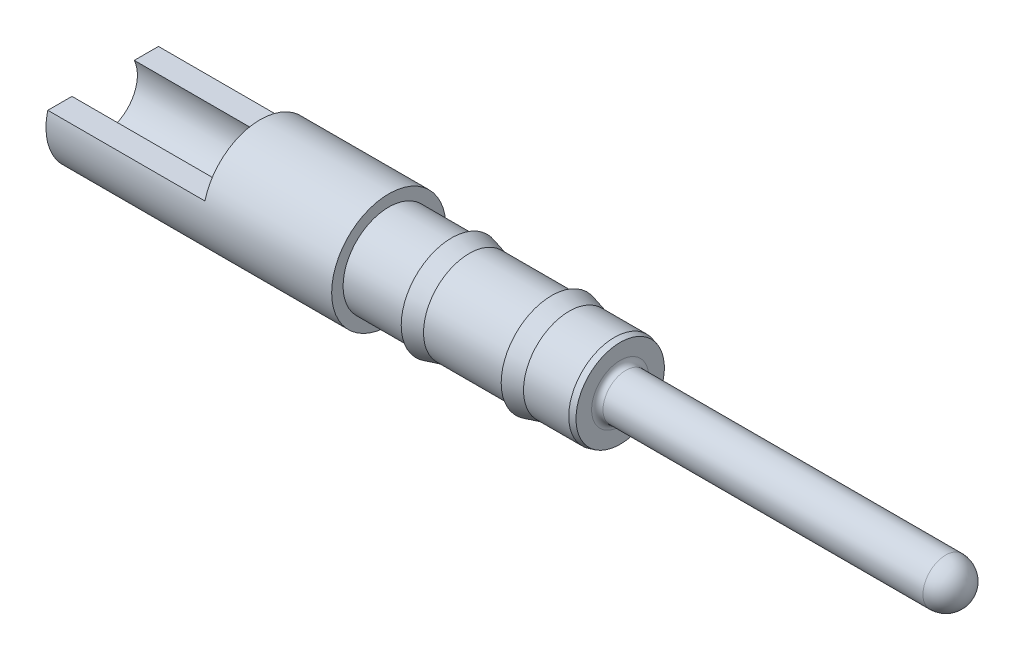
ISO-10303-21;
HEADER;
FILE_DESCRIPTION(('STEP AP214'),'2;1');
FILE_NAME('part.step','',(''),(''),'','','');
FILE_SCHEMA(('AUTOMOTIVE_DESIGN { 1 0 10303 214 1 1 1 1 }'));
ENDSEC;
DATA;
#1=APPLICATION_CONTEXT('core data for automotive mechanical design processes');
#2=APPLICATION_PROTOCOL_DEFINITION('international standard','automotive_design',2000,#1);
#3=PRODUCT_CONTEXT('',#1,'mechanical');
#4=PRODUCT('Part','Part','',(#3));
#5=PRODUCT_RELATED_PRODUCT_CATEGORY('part','',(#4));
#6=PRODUCT_DEFINITION_FORMATION('','',#4);
#7=PRODUCT_DEFINITION_CONTEXT('part definition',#1,'design');
#8=PRODUCT_DEFINITION('design','',#6,#7);
#9=PRODUCT_DEFINITION_SHAPE('','',#8);
#10=(LENGTH_UNIT() NAMED_UNIT(*) SI_UNIT(.MILLI.,.METRE.));
#11=(NAMED_UNIT(*) PLANE_ANGLE_UNIT() SI_UNIT($,.RADIAN.));
#12=(NAMED_UNIT(*) SI_UNIT($,.STERADIAN.) SOLID_ANGLE_UNIT());
#13=UNCERTAINTY_MEASURE_WITH_UNIT(LENGTH_MEASURE(1.E-05),#10,'distance_accuracy_value','');
#14=(GEOMETRIC_REPRESENTATION_CONTEXT(3) GLOBAL_UNCERTAINTY_ASSIGNED_CONTEXT((#13)) GLOBAL_UNIT_ASSIGNED_CONTEXT((#10,
#11,#12)) REPRESENTATION_CONTEXT('',''));
#15=CARTESIAN_POINT('',(0.,0.,0.));
#16=DIRECTION('',(0.,0.,1.));
#17=DIRECTION('',(1.,0.,0.));
#18=AXIS2_PLACEMENT_3D('',#15,#16,#17);
#19=CARTESIAN_POINT('',(0.,0.,0.));
#20=DIRECTION('',(-1.,0.,0.));
#21=DIRECTION('',(0.,0.,1.));
#22=AXIS2_PLACEMENT_3D('',#19,#20,#21);
#23=CYLINDRICAL_SURFACE('',#22,0.508);
#24=CARTESIAN_POINT('',(2.54,0.,0.));
#25=DIRECTION('',(-1.,0.,0.));
#26=DIRECTION('',(0.,0.,1.));
#27=AXIS2_PLACEMENT_3D('',#24,#25,#26);
#28=CIRCLE('',#27,0.508);
#29=CARTESIAN_POINT('',(2.54,0.,0.508));
#30=VERTEX_POINT('',#29);
#31=EDGE_CURVE('E86',#30,#30,#28,.T.);
#32=ORIENTED_EDGE('',*,*,#31,.T.);
#33=EDGE_LOOP('',(#32));
#34=FACE_BOUND('',#33,.T.);
#35=DIRECTION('',(-1.,0.,0.));
#36=VECTOR('',#35,1.);
#37=CARTESIAN_POINT('',(0.,0.127,-0.491868884968342));
#38=LINE('',#37,#36);
#39=CARTESIAN_POINT('',(1.397,0.127,-0.491868884968342));
#40=VERTEX_POINT('',#39);
#41=CARTESIAN_POINT('',(0.,0.127,-0.491868884968342));
#42=VERTEX_POINT('',#41);
#43=EDGE_CURVE('E67',#40,#42,#38,.T.);
#44=ORIENTED_EDGE('',*,*,#43,.F.);
#45=CARTESIAN_POINT('',(1.397,0.,0.));
#46=DIRECTION('',(-1.,0.,0.));
#47=DIRECTION('',(0.,0.,1.));
#48=AXIS2_PLACEMENT_3D('',#45,#46,#47);
#49=CIRCLE('',#48,0.508);
#50=CARTESIAN_POINT('',(1.397,0.127,0.491868884968342));
#51=VERTEX_POINT('',#50);
#52=EDGE_CURVE('E68',#51,#40,#49,.T.);
#53=ORIENTED_EDGE('',*,*,#52,.F.);
#54=DIRECTION('',(-1.,0.,0.));
#55=VECTOR('',#54,1.);
#56=CARTESIAN_POINT('',(0.,0.127,0.491868884968342));
#57=LINE('',#56,#55);
#58=CARTESIAN_POINT('',(0.,0.127,0.491868884968342));
#59=VERTEX_POINT('',#58);
#60=EDGE_CURVE('E56',#59,#51,#57,.F.);
#61=ORIENTED_EDGE('',*,*,#60,.F.);
#62=CARTESIAN_POINT('',(0.,0.,0.));
#63=DIRECTION('',(-1.,0.,0.));
#64=DIRECTION('',(0.,0.,1.));
#65=AXIS2_PLACEMENT_3D('',#62,#63,#64);
#66=CIRCLE('',#65,0.508);
#67=EDGE_CURVE('E125',#42,#59,#66,.T.);
#68=ORIENTED_EDGE('',*,*,#67,.F.);
#69=EDGE_LOOP('',(#44,#53,#61,#68));
#70=FACE_BOUND('',#69,.T.);
#71=ADVANCED_FACE('F17',(#34,#70),#23,.T.);
#72=CARTESIAN_POINT('',(0.,0.508,0.));
#73=DIRECTION('',(1.,0.,0.));
#74=DIRECTION('',(0.,0.,-1.));
#75=AXIS2_PLACEMENT_3D('',#72,#73,#74);
#76=PLANE('',#75);
#77=DIRECTION('',(0.,0.,-1.));
#78=VECTOR('',#77,1.);
#79=CARTESIAN_POINT('',(0.,0.127,2.54));
#80=LINE('',#79,#78);
#81=CARTESIAN_POINT('',(0.,0.127,-0.277081287711747));
#82=VERTEX_POINT('',#81);
#83=EDGE_CURVE('E73',#82,#42,#80,.T.);
#84=ORIENTED_EDGE('',*,*,#83,.T.);
#85=ORIENTED_EDGE('',*,*,#67,.T.);
#86=CARTESIAN_POINT('',(0.,0.127,0.277081287711747));
#87=VERTEX_POINT('',#86);
#88=EDGE_CURVE('E62',#59,#87,#80,.T.);
#89=ORIENTED_EDGE('',*,*,#88,.T.);
#90=CARTESIAN_POINT('',(0.,0.,0.));
#91=DIRECTION('',(-1.,0.,0.));
#92=DIRECTION('',(0.,0.,1.));
#93=AXIS2_PLACEMENT_3D('',#90,#91,#92);
#94=CIRCLE('',#93,0.304799999999999);
#95=EDGE_CURVE('E80',#82,#87,#94,.T.);
#96=ORIENTED_EDGE('',*,*,#95,.F.);
#97=EDGE_LOOP('',(#84,#85,#89,#96));
#98=FACE_BOUND('',#97,.T.);
#99=ADVANCED_FACE('F131',(#98),#76,.F.);
#100=CARTESIAN_POINT('',(0.,0.,0.));
#101=DIRECTION('',(-1.,0.,0.));
#102=DIRECTION('',(0.,0.,1.));
#103=AXIS2_PLACEMENT_3D('',#100,#101,#102);
#104=CYLINDRICAL_SURFACE('',#103,0.304799999999999);
#105=CARTESIAN_POINT('',(2.54,0.,0.));
#106=DIRECTION('',(-1.,0.,0.));
#107=DIRECTION('',(0.,0.,1.));
#108=AXIS2_PLACEMENT_3D('',#105,#106,#107);
#109=CIRCLE('',#108,0.3048);
#110=CARTESIAN_POINT('',(2.54,0.,0.3048));
#111=VERTEX_POINT('',#110);
#112=EDGE_CURVE('E83',#111,#111,#109,.T.);
#113=ORIENTED_EDGE('',*,*,#112,.F.);
#114=EDGE_LOOP('',(#113));
#115=FACE_BOUND('',#114,.T.);
#116=DIRECTION('',(-1.,0.,0.));
#117=VECTOR('',#116,1.);
#118=CARTESIAN_POINT('',(0.,0.127,-0.277081287711747));
#119=LINE('',#118,#117);
#120=CARTESIAN_POINT('',(1.397,0.127,-0.277081287711747));
#121=VERTEX_POINT('',#120);
#122=EDGE_CURVE('E11',#82,#121,#119,.F.);
#123=ORIENTED_EDGE('',*,*,#122,.F.);
#124=ORIENTED_EDGE('',*,*,#95,.T.);
#125=DIRECTION('',(-1.,0.,0.));
#126=VECTOR('',#125,1.);
#127=CARTESIAN_POINT('',(0.,0.127,0.277081287711747));
#128=LINE('',#127,#126);
#129=CARTESIAN_POINT('',(1.397,0.127,0.277081287711747));
#130=VERTEX_POINT('',#129);
#131=EDGE_CURVE('E24',#130,#87,#128,.T.);
#132=ORIENTED_EDGE('',*,*,#131,.F.);
#133=CARTESIAN_POINT('',(1.397,0.,0.));
#134=DIRECTION('',(-1.,0.,0.));
#135=DIRECTION('',(0.,0.,1.));
#136=AXIS2_PLACEMENT_3D('',#133,#134,#135);
#137=CIRCLE('',#136,0.304799999999999);
#138=EDGE_CURVE('E72',#121,#130,#137,.F.);
#139=ORIENTED_EDGE('',*,*,#138,.F.);
#140=EDGE_LOOP('',(#123,#124,#132,#139));
#141=FACE_BOUND('',#140,.T.);
#142=ADVANCED_FACE('F133',(#115,#141),#104,.F.);
#143=CARTESIAN_POINT('',(7.49299999999993,0.,0.));
#144=DIRECTION('',(-1.,0.,0.));
#145=DIRECTION('',(0.,1.,0.));
#146=AXIS2_PLACEMENT_3D('',#143,#144,#145);
#147=SPHERICAL_SURFACE('',#146,0.20320000000007);
#148=CARTESIAN_POINT('',(7.49299999999993,0.,0.));
#149=DIRECTION('',(-1.,0.,0.));
#150=DIRECTION('',(0.,0.,1.));
#151=AXIS2_PLACEMENT_3D('',#148,#149,#150);
#152=CIRCLE('',#151,0.203200000000042);
#153=CARTESIAN_POINT('',(7.49299999999993,0.,0.203200000000042));
#154=VERTEX_POINT('',#153);
#155=EDGE_CURVE('E122',#154,#154,#152,.T.);
#156=ORIENTED_EDGE('',*,*,#155,.F.);
#157=EDGE_LOOP('',(#156));
#158=FACE_BOUND('',#157,.T.);
#159=ADVANCED_FACE('F223',(#158),#147,.T.);
#160=CARTESIAN_POINT('',(0.,0.,0.));
#161=DIRECTION('',(-1.,0.,0.));
#162=DIRECTION('',(0.,0.,1.));
#163=AXIS2_PLACEMENT_3D('',#160,#161,#162);
#164=CYLINDRICAL_SURFACE('',#163,0.203200000000042);
#165=CARTESIAN_POINT('',(4.6482000000001,0.,0.));
#166=DIRECTION('',(-1.,0.,0.));
#167=DIRECTION('',(0.,0.,1.));
#168=AXIS2_PLACEMENT_3D('',#165,#166,#167);
#169=CIRCLE('',#168,0.203200000000042);
#170=CARTESIAN_POINT('',(4.6482000000001,0.,0.203200000000042));
#171=VERTEX_POINT('',#170);
#172=EDGE_CURVE('E119',#171,#171,#169,.T.);
#173=ORIENTED_EDGE('',*,*,#172,.F.);
#174=EDGE_LOOP('',(#173));
#175=FACE_BOUND('',#174,.T.);
#176=ORIENTED_EDGE('',*,*,#155,.T.);
#177=EDGE_LOOP('',(#176));
#178=FACE_BOUND('',#177,.T.);
#179=ADVANCED_FACE('F217',(#175,#178),#164,.T.);
#180=CARTESIAN_POINT('',(4.6482000000001,0.,0.));
#181=DIRECTION('',(-1.,0.,0.));
#182=DIRECTION('',(0.,0.,1.));
#183=AXIS2_PLACEMENT_3D('',#180,#181,#182);
#184=TOROIDAL_SURFACE('',#183,0.254000000000032,0.0507999999999898);
#185=CARTESIAN_POINT('',(4.59740000000011,0.,0.));
#186=DIRECTION('',(-1.,0.,0.));
#187=DIRECTION('',(0.,0.,1.));
#188=AXIS2_PLACEMENT_3D('',#185,#186,#187);
#189=CIRCLE('',#188,0.254000000000032);
#190=CARTESIAN_POINT('',(4.59740000000011,0.,0.254000000000032));
#191=VERTEX_POINT('',#190);
#192=EDGE_CURVE('E116',#191,#191,#189,.T.);
#193=ORIENTED_EDGE('',*,*,#192,.F.);
#194=EDGE_LOOP('',(#193));
#195=FACE_BOUND('',#194,.T.);
#196=ORIENTED_EDGE('',*,*,#172,.T.);
#197=EDGE_LOOP('',(#196));
#198=FACE_BOUND('',#197,.T.);
#199=ADVANCED_FACE('F211',(#195,#198),#184,.F.);
#200=CARTESIAN_POINT('',(4.59740000000011,0.392788181024502,0.));
#201=DIRECTION('',(-1.,0.,0.));
#202=DIRECTION('',(0.,0.,1.));
#203=AXIS2_PLACEMENT_3D('',#200,#201,#202);
#204=PLANE('',#203);
#205=CARTESIAN_POINT('',(4.59740000000011,0.,0.));
#206=DIRECTION('',(-1.,0.,0.));
#207=DIRECTION('',(0.,0.,1.));
#208=AXIS2_PLACEMENT_3D('',#205,#206,#207);
#209=CIRCLE('',#208,0.392788181024502);
#210=CARTESIAN_POINT('',(4.59740000000011,0.,0.392788181024502));
#211=VERTEX_POINT('',#210);
#212=EDGE_CURVE('E113',#211,#211,#209,.T.);
#213=ORIENTED_EDGE('',*,*,#212,.F.);
#214=EDGE_LOOP('',(#213));
#215=FACE_BOUND('',#214,.T.);
#216=ORIENTED_EDGE('',*,*,#192,.T.);
#217=EDGE_LOOP('',(#216));
#218=FACE_BOUND('',#217,.T.);
#219=ADVANCED_FACE('F205',(#215,#218),#204,.F.);
#220=CARTESIAN_POINT('',(4.59740000000011,0.,0.));
#221=DIRECTION('',(-1.,0.,0.));
#222=DIRECTION('',(0.,0.,1.));
#223=AXIS2_PLACEMENT_3D('',#220,#221,#222);
#224=CONICAL_SURFACE('',#223,0.392788181024502,0.261799387799401);
#225=CARTESIAN_POINT('',(4.54660000000007,0.,0.));
#226=DIRECTION('',(-1.,0.,0.));
#227=DIRECTION('',(0.,0.,1.));
#228=AXIS2_PLACEMENT_3D('',#225,#226,#227);
#229=CIRCLE('',#228,0.406400000000029);
#230=CARTESIAN_POINT('',(4.54660000000007,0.,0.406400000000029));
#231=VERTEX_POINT('',#230);
#232=EDGE_CURVE('E110',#231,#231,#229,.T.);
#233=ORIENTED_EDGE('',*,*,#232,.F.);
#234=EDGE_LOOP('',(#233));
#235=FACE_BOUND('',#234,.T.);
#236=ORIENTED_EDGE('',*,*,#212,.T.);
#237=EDGE_LOOP('',(#236));
#238=FACE_BOUND('',#237,.T.);
#239=ADVANCED_FACE('F199',(#235,#238),#224,.T.);
#240=CARTESIAN_POINT('',(0.,0.,0.));
#241=DIRECTION('',(-1.,0.,0.));
#242=DIRECTION('',(0.,0.,1.));
#243=AXIS2_PLACEMENT_3D('',#240,#241,#242);
#244=CYLINDRICAL_SURFACE('',#243,0.406400000000029);
#245=CARTESIAN_POINT('',(4.14421024934499,0.,0.));
#246=DIRECTION('',(-1.,0.,0.));
#247=DIRECTION('',(0.,0.,1.));
#248=AXIS2_PLACEMENT_3D('',#245,#246,#247);
#249=CIRCLE('',#248,0.406400000000029);
#250=CARTESIAN_POINT('',(4.14421024934499,0.,0.406400000000029));
#251=VERTEX_POINT('',#250);
#252=EDGE_CURVE('E107',#251,#251,#249,.T.);
#253=ORIENTED_EDGE('',*,*,#252,.F.);
#254=EDGE_LOOP('',(#253));
#255=FACE_BOUND('',#254,.T.);
#256=ORIENTED_EDGE('',*,*,#232,.T.);
#257=EDGE_LOOP('',(#256));
#258=FACE_BOUND('',#257,.T.);
#259=ADVANCED_FACE('F193',(#255,#258),#244,.T.);
#260=CARTESIAN_POINT('',(4.14421024934499,0.,0.));
#261=DIRECTION('',(-1.,0.,0.));
#262=DIRECTION('',(0.,0.,1.));
#263=AXIS2_PLACEMENT_3D('',#260,#261,#262);
#264=CONICAL_SURFACE('',#263,0.406400000000029,0.261799387799401);
#265=CARTESIAN_POINT('',(3.98780000000004,0.,0.));
#266=DIRECTION('',(-1.,0.,0.));
#267=DIRECTION('',(0.,0.,1.));
#268=AXIS2_PLACEMENT_3D('',#265,#266,#267);
#269=CIRCLE('',#268,0.44831);
#270=CARTESIAN_POINT('',(3.98780000000004,0.,0.44831));
#271=VERTEX_POINT('',#270);
#272=EDGE_CURVE('E104',#271,#271,#269,.T.);
#273=ORIENTED_EDGE('',*,*,#272,.F.);
#274=EDGE_LOOP('',(#273));
#275=FACE_BOUND('',#274,.T.);
#276=ORIENTED_EDGE('',*,*,#252,.T.);
#277=EDGE_LOOP('',(#276));
#278=FACE_BOUND('',#277,.T.);
#279=ADVANCED_FACE('F187',(#275,#278),#264,.T.);
#280=CARTESIAN_POINT('',(3.98780000000004,0.406400000000029,0.));
#281=DIRECTION('',(1.,0.,0.));
#282=DIRECTION('',(0.,0.,-1.));
#283=AXIS2_PLACEMENT_3D('',#280,#281,#282);
#284=PLANE('',#283);
#285=CARTESIAN_POINT('',(3.98780000000004,0.,0.));
#286=DIRECTION('',(-1.,0.,0.));
#287=DIRECTION('',(0.,0.,1.));
#288=AXIS2_PLACEMENT_3D('',#285,#286,#287);
#289=CIRCLE('',#288,0.406400000000029);
#290=CARTESIAN_POINT('',(3.98780000000004,0.,0.406400000000029));
#291=VERTEX_POINT('',#290);
#292=EDGE_CURVE('E101',#291,#291,#289,.T.);
#293=ORIENTED_EDGE('',*,*,#292,.F.);
#294=EDGE_LOOP('',(#293));
#295=FACE_BOUND('',#294,.T.);
#296=ORIENTED_EDGE('',*,*,#272,.T.);
#297=EDGE_LOOP('',(#296));
#298=FACE_BOUND('',#297,.T.);
#299=ADVANCED_FACE('F181',(#295,#298),#284,.F.);
#300=CARTESIAN_POINT('',(0.,0.,0.));
#301=DIRECTION('',(-1.,0.,0.));
#302=DIRECTION('',(0.,0.,1.));
#303=AXIS2_PLACEMENT_3D('',#300,#301,#302);
#304=CYLINDRICAL_SURFACE('',#303,0.406400000000029);
#305=CARTESIAN_POINT('',(3.25521024934496,0.,0.));
#306=DIRECTION('',(-1.,0.,0.));
#307=DIRECTION('',(0.,0.,1.));
#308=AXIS2_PLACEMENT_3D('',#305,#306,#307);
#309=CIRCLE('',#308,0.406400000000029);
#310=CARTESIAN_POINT('',(3.25521024934496,0.,0.406400000000029));
#311=VERTEX_POINT('',#310);
#312=EDGE_CURVE('E98',#311,#311,#309,.T.);
#313=ORIENTED_EDGE('',*,*,#312,.F.);
#314=EDGE_LOOP('',(#313));
#315=FACE_BOUND('',#314,.T.);
#316=ORIENTED_EDGE('',*,*,#292,.T.);
#317=EDGE_LOOP('',(#316));
#318=FACE_BOUND('',#317,.T.);
#319=ADVANCED_FACE('F175',(#315,#318),#304,.T.);
#320=CARTESIAN_POINT('',(3.25521024934496,0.,0.));
#321=DIRECTION('',(-1.,0.,0.));
#322=DIRECTION('',(0.,0.,1.));
#323=AXIS2_PLACEMENT_3D('',#320,#321,#322);
#324=CONICAL_SURFACE('',#323,0.406400000000029,0.2617993877994);
#325=CARTESIAN_POINT('',(3.09880000000001,0.,0.));
#326=DIRECTION('',(-1.,0.,0.));
#327=DIRECTION('',(0.,0.,1.));
#328=AXIS2_PLACEMENT_3D('',#325,#326,#327);
#329=CIRCLE('',#328,0.44831);
#330=CARTESIAN_POINT('',(3.09880000000001,0.,0.44831));
#331=VERTEX_POINT('',#330);
#332=EDGE_CURVE('E95',#331,#331,#329,.T.);
#333=ORIENTED_EDGE('',*,*,#332,.F.);
#334=EDGE_LOOP('',(#333));
#335=FACE_BOUND('',#334,.T.);
#336=ORIENTED_EDGE('',*,*,#312,.T.);
#337=EDGE_LOOP('',(#336));
#338=FACE_BOUND('',#337,.T.);
#339=ADVANCED_FACE('F169',(#335,#338),#324,.T.);
#340=CARTESIAN_POINT('',(3.09880000000001,0.406400000000029,0.));
#341=DIRECTION('',(1.,0.,0.));
#342=DIRECTION('',(0.,0.,-1.));
#343=AXIS2_PLACEMENT_3D('',#340,#341,#342);
#344=PLANE('',#343);
#345=CARTESIAN_POINT('',(3.09880000000001,0.,0.));
#346=DIRECTION('',(-1.,0.,0.));
#347=DIRECTION('',(0.,0.,1.));
#348=AXIS2_PLACEMENT_3D('',#345,#346,#347);
#349=CIRCLE('',#348,0.406400000000029);
#350=CARTESIAN_POINT('',(3.09880000000001,0.,0.406400000000029));
#351=VERTEX_POINT('',#350);
#352=EDGE_CURVE('E92',#351,#351,#349,.T.);
#353=ORIENTED_EDGE('',*,*,#352,.F.);
#354=EDGE_LOOP('',(#353));
#355=FACE_BOUND('',#354,.T.);
#356=ORIENTED_EDGE('',*,*,#332,.T.);
#357=EDGE_LOOP('',(#356));
#358=FACE_BOUND('',#357,.T.);
#359=ADVANCED_FACE('F163',(#355,#358),#344,.F.);
#360=CARTESIAN_POINT('',(0.,0.,0.));
#361=DIRECTION('',(-1.,0.,0.));
#362=DIRECTION('',(0.,0.,1.));
#363=AXIS2_PLACEMENT_3D('',#360,#361,#362);
#364=CYLINDRICAL_SURFACE('',#363,0.406400000000029);
#365=CARTESIAN_POINT('',(2.54,0.,0.));
#366=DIRECTION('',(-1.,0.,0.));
#367=DIRECTION('',(0.,0.,1.));
#368=AXIS2_PLACEMENT_3D('',#365,#366,#367);
#369=CIRCLE('',#368,0.406400000000029);
#370=CARTESIAN_POINT('',(2.54,0.,0.406400000000029));
#371=VERTEX_POINT('',#370);
#372=EDGE_CURVE('E89',#371,#371,#369,.T.);
#373=ORIENTED_EDGE('',*,*,#372,.F.);
#374=EDGE_LOOP('',(#373));
#375=FACE_BOUND('',#374,.T.);
#376=ORIENTED_EDGE('',*,*,#352,.T.);
#377=EDGE_LOOP('',(#376));
#378=FACE_BOUND('',#377,.T.);
#379=ADVANCED_FACE('F157',(#375,#378),#364,.T.);
#380=CARTESIAN_POINT('',(2.54,0.406400000000029,0.));
#381=DIRECTION('',(-1.,0.,0.));
#382=DIRECTION('',(0.,0.,1.));
#383=AXIS2_PLACEMENT_3D('',#380,#381,#382);
#384=PLANE('',#383);
#385=ORIENTED_EDGE('',*,*,#31,.F.);
#386=EDGE_LOOP('',(#385));
#387=FACE_BOUND('',#386,.T.);
#388=ORIENTED_EDGE('',*,*,#372,.T.);
#389=EDGE_LOOP('',(#388));
#390=FACE_BOUND('',#389,.T.);
#391=ADVANCED_FACE('F144',(#387,#390),#384,.F.);
#392=CARTESIAN_POINT('',(2.54,0.,0.));
#393=DIRECTION('',(-1.,0.,0.));
#394=DIRECTION('',(0.,0.,1.));
#395=AXIS2_PLACEMENT_3D('',#392,#393,#394);
#396=CONICAL_SURFACE('',#395,0.3048,1.02974425867666);
#397=CARTESIAN_POINT('',(2.7231423166796,0.,0.));
#398=VERTEX_POINT('',#397);
#399=VERTEX_LOOP('',#398);
#400=FACE_BOUND('',#399,.T.);
#401=ORIENTED_EDGE('',*,*,#112,.T.);
#402=EDGE_LOOP('',(#401));
#403=FACE_BOUND('',#402,.T.);
#404=ADVANCED_FACE('F137',(#400,#403),#396,.F.);
#405=CARTESIAN_POINT('',(0.,0.127,2.54));
#406=DIRECTION('',(0.,1.,0.));
#407=DIRECTION('',(-1.,0.,0.));
#408=AXIS2_PLACEMENT_3D('',#405,#406,#407);
#409=PLANE('',#408);
#410=ORIENTED_EDGE('',*,*,#43,.T.);
#411=ORIENTED_EDGE('',*,*,#83,.F.);
#412=ORIENTED_EDGE('',*,*,#122,.T.);
#413=DIRECTION('',(0.,0.,-1.));
#414=VECTOR('',#413,1.);
#415=CARTESIAN_POINT('',(1.397,0.127,2.54));
#416=LINE('',#415,#414);
#417=EDGE_CURVE('E31',#121,#40,#416,.T.);
#418=ORIENTED_EDGE('',*,*,#417,.T.);
#419=EDGE_LOOP('',(#410,#411,#412,#418));
#420=FACE_BOUND('',#419,.T.);
#421=ADVANCED_FACE('F135',(#420),#409,.T.);
#422=ORIENTED_EDGE('',*,*,#60,.T.);
#423=EDGE_CURVE('E59',#51,#130,#416,.T.);
#424=ORIENTED_EDGE('',*,*,#423,.T.);
#425=ORIENTED_EDGE('',*,*,#131,.T.);
#426=ORIENTED_EDGE('',*,*,#88,.F.);
#427=EDGE_LOOP('',(#422,#424,#425,#426));
#428=FACE_BOUND('',#427,.T.);
#429=ADVANCED_FACE('F58',(#428),#409,.T.);
#430=CARTESIAN_POINT('',(1.397,0.127,2.54));
#431=DIRECTION('',(-1.,0.,0.));
#432=DIRECTION('',(0.,0.,1.));
#433=AXIS2_PLACEMENT_3D('',#430,#431,#432);
#434=PLANE('',#433);
#435=ORIENTED_EDGE('',*,*,#52,.T.);
#436=ORIENTED_EDGE('',*,*,#417,.F.);
#437=ORIENTED_EDGE('',*,*,#138,.T.);
#438=ORIENTED_EDGE('',*,*,#423,.F.);
#439=EDGE_LOOP('',(#435,#436,#437,#438));
#440=FACE_BOUND('',#439,.T.);
#441=ADVANCED_FACE('F70',(#440),#434,.T.);
#442=CLOSED_SHELL('',(#71,#99,#142,#159,#179,#199,#219,#239,#259,#279,#299,#319,#339,#359,#379,
#391,#404,#421,#429,#441));
#443=MANIFOLD_SOLID_BREP('B1',#442);
#444=ADVANCED_BREP_SHAPE_REPRESENTATION('',(#18,#443),#14);
#445=SHAPE_DEFINITION_REPRESENTATION(#9,#444);
ENDSEC;
END-ISO-10303-21;
